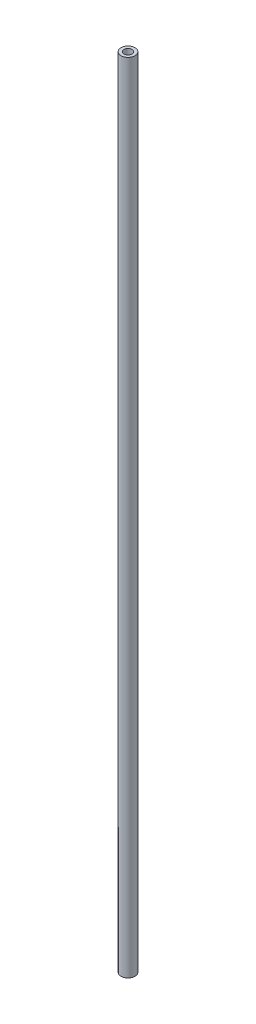
ISO-10303-21;
HEADER;
FILE_DESCRIPTION(('STEP AP214'),'2;1');
FILE_NAME('part.step','',(''),(''),'','','');
FILE_SCHEMA(('AUTOMOTIVE_DESIGN { 1 0 10303 214 1 1 1 1 }'));
ENDSEC;
DATA;
#1=APPLICATION_CONTEXT('core data for automotive mechanical design processes');
#2=APPLICATION_PROTOCOL_DEFINITION('international standard','automotive_design',2000,#1);
#3=PRODUCT_CONTEXT('',#1,'mechanical');
#4=PRODUCT('Part','Part','',(#3));
#5=PRODUCT_RELATED_PRODUCT_CATEGORY('part','',(#4));
#6=PRODUCT_DEFINITION_FORMATION('','',#4);
#7=PRODUCT_DEFINITION_CONTEXT('part definition',#1,'design');
#8=PRODUCT_DEFINITION('design','',#6,#7);
#9=PRODUCT_DEFINITION_SHAPE('','',#8);
#10=(LENGTH_UNIT() NAMED_UNIT(*) SI_UNIT(.MILLI.,.METRE.));
#11=(NAMED_UNIT(*) PLANE_ANGLE_UNIT() SI_UNIT($,.RADIAN.));
#12=(NAMED_UNIT(*) SI_UNIT($,.STERADIAN.) SOLID_ANGLE_UNIT());
#13=UNCERTAINTY_MEASURE_WITH_UNIT(LENGTH_MEASURE(1.E-05),#10,'distance_accuracy_value','');
#14=(GEOMETRIC_REPRESENTATION_CONTEXT(3) GLOBAL_UNCERTAINTY_ASSIGNED_CONTEXT((#13)) GLOBAL_UNIT_ASSIGNED_CONTEXT((#10,
#11,#12)) REPRESENTATION_CONTEXT('',''));
#15=CARTESIAN_POINT('',(0.,0.,0.));
#16=DIRECTION('',(0.,0.,1.));
#17=DIRECTION('',(1.,0.,0.));
#18=AXIS2_PLACEMENT_3D('',#15,#16,#17);
#19=CARTESIAN_POINT('',(0.,200.,0.));
#20=DIRECTION('',(0.,1.,0.));
#21=DIRECTION('',(0.,0.,1.));
#22=AXIS2_PLACEMENT_3D('',#19,#20,#21);
#23=PLANE('',#22);
#24=CARTESIAN_POINT('',(0.,200.,0.));
#25=DIRECTION('',(0.,1.,0.));
#26=DIRECTION('',(0.,0.,1.));
#27=AXIS2_PLACEMENT_3D('',#24,#25,#26);
#28=CIRCLE('',#27,1.75);
#29=CARTESIAN_POINT('',(0.,200.,1.75));
#30=VERTEX_POINT('',#29);
#31=EDGE_CURVE('E10',#30,#30,#28,.T.);
#32=ORIENTED_EDGE('',*,*,#31,.T.);
#33=EDGE_LOOP('',(#32));
#34=FACE_BOUND('',#33,.T.);
#35=CARTESIAN_POINT('',(0.,200.,0.));
#36=DIRECTION('',(0.,1.,0.));
#37=DIRECTION('',(0.,0.,1.));
#38=AXIS2_PLACEMENT_3D('',#35,#36,#37);
#39=CIRCLE('',#38,1.);
#40=CARTESIAN_POINT('',(0.,200.,1.));
#41=VERTEX_POINT('',#40);
#42=EDGE_CURVE('E25',#41,#41,#39,.T.);
#43=ORIENTED_EDGE('',*,*,#42,.F.);
#44=EDGE_LOOP('',(#43));
#45=FACE_BOUND('',#44,.T.);
#46=ADVANCED_FACE('F14',(#34,#45),#23,.T.);
#47=CARTESIAN_POINT('',(0.,0.,0.));
#48=DIRECTION('',(0.,1.,0.));
#49=DIRECTION('',(0.,0.,1.));
#50=AXIS2_PLACEMENT_3D('',#47,#48,#49);
#51=PLANE('',#50);
#52=CARTESIAN_POINT('',(0.,0.,0.));
#53=DIRECTION('',(0.,1.,0.));
#54=DIRECTION('',(0.,0.,1.));
#55=AXIS2_PLACEMENT_3D('',#52,#53,#54);
#56=CIRCLE('',#55,1.75);
#57=CARTESIAN_POINT('',(0.,0.,1.75));
#58=VERTEX_POINT('',#57);
#59=EDGE_CURVE('E18',#58,#58,#56,.T.);
#60=ORIENTED_EDGE('',*,*,#59,.F.);
#61=EDGE_LOOP('',(#60));
#62=FACE_BOUND('',#61,.T.);
#63=CARTESIAN_POINT('',(0.,0.,0.));
#64=DIRECTION('',(0.,1.,0.));
#65=DIRECTION('',(0.,0.,1.));
#66=AXIS2_PLACEMENT_3D('',#63,#64,#65);
#67=CIRCLE('',#66,1.);
#68=CARTESIAN_POINT('',(0.,0.,1.));
#69=VERTEX_POINT('',#68);
#70=EDGE_CURVE('E27',#69,#69,#67,.T.);
#71=ORIENTED_EDGE('',*,*,#70,.T.);
#72=EDGE_LOOP('',(#71));
#73=FACE_BOUND('',#72,.T.);
#74=ADVANCED_FACE('F37',(#62,#73),#51,.F.);
#75=CARTESIAN_POINT('',(0.,200.,0.));
#76=DIRECTION('',(0.,-1.,0.));
#77=DIRECTION('',(0.,0.,-1.));
#78=AXIS2_PLACEMENT_3D('',#75,#76,#77);
#79=CYLINDRICAL_SURFACE('',#78,1.75);
#80=ORIENTED_EDGE('',*,*,#31,.F.);
#81=EDGE_LOOP('',(#80));
#82=FACE_BOUND('',#81,.T.);
#83=ORIENTED_EDGE('',*,*,#59,.T.);
#84=EDGE_LOOP('',(#83));
#85=FACE_BOUND('',#84,.T.);
#86=ADVANCED_FACE('F16',(#82,#85),#79,.T.);
#87=CARTESIAN_POINT('',(0.,200.,0.));
#88=DIRECTION('',(0.,-1.,0.));
#89=DIRECTION('',(0.,0.,-1.));
#90=AXIS2_PLACEMENT_3D('',#87,#88,#89);
#91=CYLINDRICAL_SURFACE('',#90,1.);
#92=ORIENTED_EDGE('',*,*,#42,.T.);
#93=EDGE_LOOP('',(#92));
#94=FACE_BOUND('',#93,.T.);
#95=ORIENTED_EDGE('',*,*,#70,.F.);
#96=EDGE_LOOP('',(#95));
#97=FACE_BOUND('',#96,.T.);
#98=ADVANCED_FACE('F33',(#94,#97),#91,.F.);
#99=CLOSED_SHELL('',(#46,#74,#86,#98));
#100=MANIFOLD_SOLID_BREP('B1',#99);
#101=ADVANCED_BREP_SHAPE_REPRESENTATION('',(#18,#100),#14);
#102=SHAPE_DEFINITION_REPRESENTATION(#9,#101);
ENDSEC;
END-ISO-10303-21;
